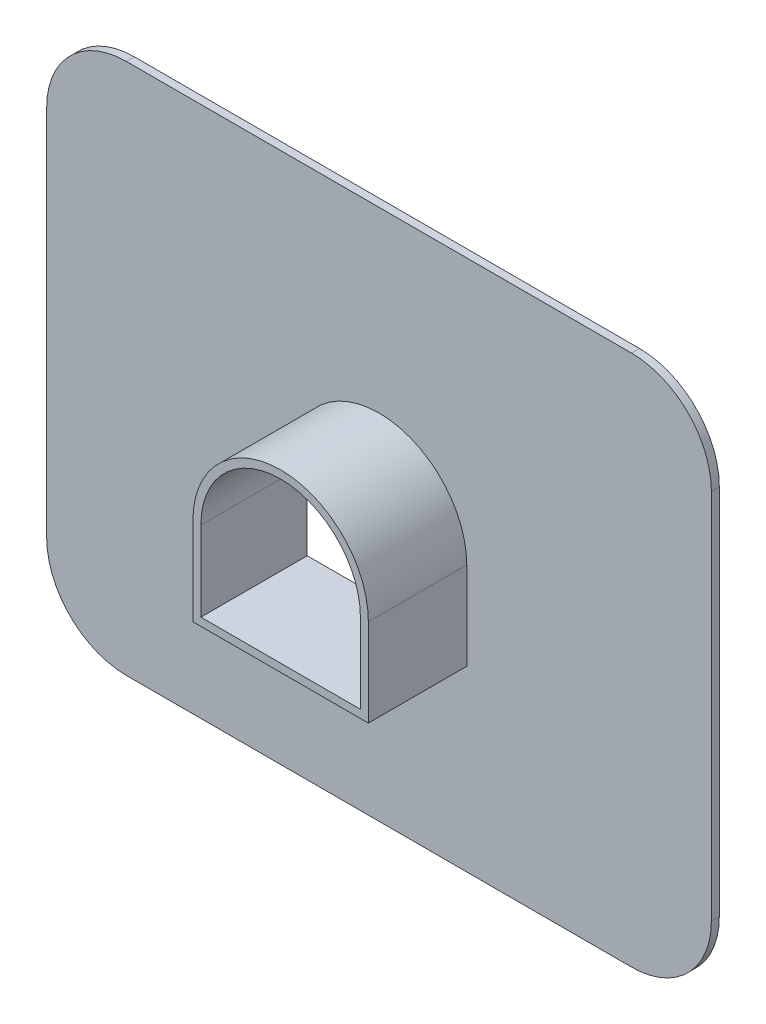
ISO-10303-21;
HEADER;
FILE_DESCRIPTION(('STEP AP214'),'2;1');
FILE_NAME('part.step','',(''),(''),'','','');
FILE_SCHEMA(('AUTOMOTIVE_DESIGN { 1 0 10303 214 1 1 1 1 }'));
ENDSEC;
DATA;
#1=APPLICATION_CONTEXT('core data for automotive mechanical design processes');
#2=APPLICATION_PROTOCOL_DEFINITION('international standard','automotive_design',2000,#1);
#3=PRODUCT_CONTEXT('',#1,'mechanical');
#4=PRODUCT('Part','Part','',(#3));
#5=PRODUCT_RELATED_PRODUCT_CATEGORY('part','',(#4));
#6=PRODUCT_DEFINITION_FORMATION('','',#4);
#7=PRODUCT_DEFINITION_CONTEXT('part definition',#1,'design');
#8=PRODUCT_DEFINITION('design','',#6,#7);
#9=PRODUCT_DEFINITION_SHAPE('','',#8);
#10=(LENGTH_UNIT() NAMED_UNIT(*) SI_UNIT(.MILLI.,.METRE.));
#11=(NAMED_UNIT(*) PLANE_ANGLE_UNIT() SI_UNIT($,.RADIAN.));
#12=(NAMED_UNIT(*) SI_UNIT($,.STERADIAN.) SOLID_ANGLE_UNIT());
#13=UNCERTAINTY_MEASURE_WITH_UNIT(LENGTH_MEASURE(1.E-05),#10,'distance_accuracy_value','');
#14=(GEOMETRIC_REPRESENTATION_CONTEXT(3) GLOBAL_UNCERTAINTY_ASSIGNED_CONTEXT((#13)) GLOBAL_UNIT_ASSIGNED_CONTEXT((#10,
#11,#12)) REPRESENTATION_CONTEXT('',''));
#15=CARTESIAN_POINT('',(0.,0.,0.));
#16=DIRECTION('',(0.,0.,1.));
#17=DIRECTION('',(1.,0.,0.));
#18=AXIS2_PLACEMENT_3D('',#15,#16,#17);
#19=CARTESIAN_POINT('',(9.5,7.,0.3));
#20=DIRECTION('',(0.,0.,-1.));
#21=DIRECTION('',(-1.,0.,0.));
#22=AXIS2_PLACEMENT_3D('',#19,#20,#21);
#23=PLANE('',#22);
#24=CARTESIAN_POINT('',(9.5,7.,0.3));
#25=DIRECTION('',(0.,0.,1.));
#26=DIRECTION('',(-1.,0.,0.));
#27=AXIS2_PLACEMENT_3D('',#24,#25,#26);
#28=CIRCLE('',#27,3.);
#29=CARTESIAN_POINT('',(12.5,6.99999999999998,0.3));
#30=VERTEX_POINT('',#29);
#31=CARTESIAN_POINT('',(9.49999999999998,10.,0.3));
#32=VERTEX_POINT('',#31);
#33=EDGE_CURVE('E214',#30,#32,#28,.T.);
#34=ORIENTED_EDGE('',*,*,#33,.T.);
#35=DIRECTION('',(-1.,0.,0.));
#36=VECTOR('',#35,1.);
#37=CARTESIAN_POINT('',(-9.49999999999998,10.,0.3));
#38=LINE('',#37,#36);
#39=CARTESIAN_POINT('',(-9.49999999999998,10.,0.3));
#40=VERTEX_POINT('',#39);
#41=EDGE_CURVE('E217',#32,#40,#38,.T.);
#42=ORIENTED_EDGE('',*,*,#41,.T.);
#43=CARTESIAN_POINT('',(-9.5,7.,0.3));
#44=DIRECTION('',(0.,0.,1.));
#45=DIRECTION('',(-1.,0.,0.));
#46=AXIS2_PLACEMENT_3D('',#43,#44,#45);
#47=CIRCLE('',#46,3.);
#48=CARTESIAN_POINT('',(-12.5,6.99999999999998,0.3));
#49=VERTEX_POINT('',#48);
#50=EDGE_CURVE('E220',#40,#49,#47,.T.);
#51=ORIENTED_EDGE('',*,*,#50,.T.);
#52=DIRECTION('',(0.,-1.,0.));
#53=VECTOR('',#52,1.);
#54=CARTESIAN_POINT('',(-12.5,6.99999999999998,0.3));
#55=LINE('',#54,#53);
#56=CARTESIAN_POINT('',(-12.5,-6.99999999999998,0.3));
#57=VERTEX_POINT('',#56);
#58=EDGE_CURVE('E222',#49,#57,#55,.T.);
#59=ORIENTED_EDGE('',*,*,#58,.T.);
#60=CARTESIAN_POINT('',(-9.5,-7.,0.3));
#61=DIRECTION('',(0.,0.,1.));
#62=DIRECTION('',(-1.,0.,0.));
#63=AXIS2_PLACEMENT_3D('',#60,#61,#62);
#64=CIRCLE('',#63,3.);
#65=CARTESIAN_POINT('',(-9.49999999999998,-10.,0.3));
#66=VERTEX_POINT('',#65);
#67=EDGE_CURVE('E224',#57,#66,#64,.T.);
#68=ORIENTED_EDGE('',*,*,#67,.T.);
#69=DIRECTION('',(1.,0.,0.));
#70=VECTOR('',#69,1.);
#71=CARTESIAN_POINT('',(-9.49999999999998,-10.,0.3));
#72=LINE('',#71,#70);
#73=CARTESIAN_POINT('',(9.49999999999998,-10.,0.3));
#74=VERTEX_POINT('',#73);
#75=EDGE_CURVE('E226',#66,#74,#72,.T.);
#76=ORIENTED_EDGE('',*,*,#75,.T.);
#77=CARTESIAN_POINT('',(9.50000000000001,-7.,0.3));
#78=DIRECTION('',(0.,0.,1.));
#79=DIRECTION('',(-1.,0.,0.));
#80=AXIS2_PLACEMENT_3D('',#77,#78,#79);
#81=CIRCLE('',#80,3.);
#82=CARTESIAN_POINT('',(12.5,-6.99999999999998,0.3));
#83=VERTEX_POINT('',#82);
#84=EDGE_CURVE('E228',#74,#83,#81,.T.);
#85=ORIENTED_EDGE('',*,*,#84,.T.);
#86=DIRECTION('',(0.,1.,0.));
#87=VECTOR('',#86,1.);
#88=CARTESIAN_POINT('',(12.5,6.99999999999998,0.3));
#89=LINE('',#88,#87);
#90=EDGE_CURVE('E230',#83,#30,#89,.T.);
#91=ORIENTED_EDGE('',*,*,#90,.T.);
#92=EDGE_LOOP('',(#34,#42,#51,#59,#68,#76,#85,#91));
#93=FACE_BOUND('',#92,.T.);
#94=DIRECTION('',(0.,-1.,0.));
#95=VECTOR('',#94,1.);
#96=CARTESIAN_POINT('',(-3.3,0.,0.3));
#97=LINE('',#96,#95);
#98=CARTESIAN_POINT('',(-3.3,0.,0.3));
#99=VERTEX_POINT('',#98);
#100=CARTESIAN_POINT('',(-3.3,-3.3,0.3));
#101=VERTEX_POINT('',#100);
#102=EDGE_CURVE('E173',#99,#101,#97,.T.);
#103=ORIENTED_EDGE('',*,*,#102,.F.);
#104=CARTESIAN_POINT('',(0.,0.,0.3));
#105=DIRECTION('',(0.,0.,1.));
#106=DIRECTION('',(1.,0.,0.));
#107=AXIS2_PLACEMENT_3D('',#104,#105,#106);
#108=CIRCLE('',#107,3.3);
#109=CARTESIAN_POINT('',(3.3,0.,0.3));
#110=VERTEX_POINT('',#109);
#111=EDGE_CURVE('E178',#110,#99,#108,.T.);
#112=ORIENTED_EDGE('',*,*,#111,.F.);
#113=DIRECTION('',(0.,1.,0.));
#114=VECTOR('',#113,1.);
#115=CARTESIAN_POINT('',(3.3,-3.3,0.3));
#116=LINE('',#115,#114);
#117=CARTESIAN_POINT('',(3.3,-3.3,0.3));
#118=VERTEX_POINT('',#117);
#119=EDGE_CURVE('E52',#118,#110,#116,.T.);
#120=ORIENTED_EDGE('',*,*,#119,.F.);
#121=DIRECTION('',(1.,0.,0.));
#122=VECTOR('',#121,1.);
#123=CARTESIAN_POINT('',(-3.3,-3.3,0.3));
#124=LINE('',#123,#122);
#125=EDGE_CURVE('E47',#101,#118,#124,.T.);
#126=ORIENTED_EDGE('',*,*,#125,.F.);
#127=EDGE_LOOP('',(#103,#112,#120,#126));
#128=FACE_BOUND('',#127,.T.);
#129=ADVANCED_FACE('F32',(#93,#128),#23,.F.);
#130=CARTESIAN_POINT('',(9.5,7.,0.));
#131=DIRECTION('',(0.,0.,-1.));
#132=DIRECTION('',(-1.,0.,0.));
#133=AXIS2_PLACEMENT_3D('',#130,#131,#132);
#134=PLANE('',#133);
#135=CARTESIAN_POINT('',(9.5,7.,0.));
#136=DIRECTION('',(0.,0.,1.));
#137=DIRECTION('',(-1.,0.,0.));
#138=AXIS2_PLACEMENT_3D('',#135,#136,#137);
#139=CIRCLE('',#138,3.);
#140=CARTESIAN_POINT('',(12.5,6.99999999999998,0.));
#141=VERTEX_POINT('',#140);
#142=CARTESIAN_POINT('',(9.49999999999998,10.,0.));
#143=VERTEX_POINT('',#142);
#144=EDGE_CURVE('E153',#141,#143,#139,.T.);
#145=ORIENTED_EDGE('',*,*,#144,.F.);
#146=DIRECTION('',(0.,1.,0.));
#147=VECTOR('',#146,1.);
#148=CARTESIAN_POINT('',(12.5,6.99999999999998,0.));
#149=LINE('',#148,#147);
#150=CARTESIAN_POINT('',(12.5,-6.99999999999998,0.));
#151=VERTEX_POINT('',#150);
#152=EDGE_CURVE('E218',#151,#141,#149,.T.);
#153=ORIENTED_EDGE('',*,*,#152,.F.);
#154=CARTESIAN_POINT('',(9.50000000000001,-7.,0.));
#155=DIRECTION('',(0.,0.,1.));
#156=DIRECTION('',(-1.,0.,0.));
#157=AXIS2_PLACEMENT_3D('',#154,#155,#156);
#158=CIRCLE('',#157,3.);
#159=CARTESIAN_POINT('',(9.49999999999998,-10.,0.));
#160=VERTEX_POINT('',#159);
#161=EDGE_CURVE('E245',#160,#151,#158,.T.);
#162=ORIENTED_EDGE('',*,*,#161,.F.);
#163=DIRECTION('',(1.,0.,0.));
#164=VECTOR('',#163,1.);
#165=CARTESIAN_POINT('',(-9.49999999999998,-10.,0.));
#166=LINE('',#165,#164);
#167=CARTESIAN_POINT('',(-9.49999999999998,-10.,0.));
#168=VERTEX_POINT('',#167);
#169=EDGE_CURVE('E243',#168,#160,#166,.T.);
#170=ORIENTED_EDGE('',*,*,#169,.F.);
#171=CARTESIAN_POINT('',(-9.5,-7.,0.));
#172=DIRECTION('',(0.,0.,1.));
#173=DIRECTION('',(-1.,0.,0.));
#174=AXIS2_PLACEMENT_3D('',#171,#172,#173);
#175=CIRCLE('',#174,3.);
#176=CARTESIAN_POINT('',(-12.5,-6.99999999999998,0.));
#177=VERTEX_POINT('',#176);
#178=EDGE_CURVE('E241',#177,#168,#175,.T.);
#179=ORIENTED_EDGE('',*,*,#178,.F.);
#180=DIRECTION('',(0.,-1.,0.));
#181=VECTOR('',#180,1.);
#182=CARTESIAN_POINT('',(-12.5,6.99999999999998,0.));
#183=LINE('',#182,#181);
#184=CARTESIAN_POINT('',(-12.5,6.99999999999998,0.));
#185=VERTEX_POINT('',#184);
#186=EDGE_CURVE('E239',#185,#177,#183,.T.);
#187=ORIENTED_EDGE('',*,*,#186,.F.);
#188=CARTESIAN_POINT('',(-9.5,7.,0.));
#189=DIRECTION('',(0.,0.,1.));
#190=DIRECTION('',(-1.,0.,0.));
#191=AXIS2_PLACEMENT_3D('',#188,#189,#190);
#192=CIRCLE('',#191,3.);
#193=CARTESIAN_POINT('',(-9.49999999999998,10.,0.));
#194=VERTEX_POINT('',#193);
#195=EDGE_CURVE('E237',#194,#185,#192,.T.);
#196=ORIENTED_EDGE('',*,*,#195,.F.);
#197=DIRECTION('',(-1.,0.,0.));
#198=VECTOR('',#197,1.);
#199=CARTESIAN_POINT('',(-9.49999999999998,10.,0.));
#200=LINE('',#199,#198);
#201=EDGE_CURVE('E235',#143,#194,#200,.T.);
#202=ORIENTED_EDGE('',*,*,#201,.F.);
#203=EDGE_LOOP('',(#145,#153,#162,#170,#179,#187,#196,#202));
#204=FACE_BOUND('',#203,.T.);
#205=CARTESIAN_POINT('',(0.,0.,0.));
#206=DIRECTION('',(0.,0.,1.));
#207=DIRECTION('',(-1.,0.,0.));
#208=AXIS2_PLACEMENT_3D('',#205,#206,#207);
#209=CIRCLE('',#208,3.);
#210=CARTESIAN_POINT('',(3.,0.,0.));
#211=VERTEX_POINT('',#210);
#212=CARTESIAN_POINT('',(-3.,0.,0.));
#213=VERTEX_POINT('',#212);
#214=EDGE_CURVE('E207',#211,#213,#209,.T.);
#215=ORIENTED_EDGE('',*,*,#214,.T.);
#216=DIRECTION('',(0.,-1.,0.));
#217=VECTOR('',#216,1.);
#218=CARTESIAN_POINT('',(-3.,-3.,0.));
#219=LINE('',#218,#217);
#220=CARTESIAN_POINT('',(-3.,-3.,0.));
#221=VERTEX_POINT('',#220);
#222=EDGE_CURVE('E201',#213,#221,#219,.T.);
#223=ORIENTED_EDGE('',*,*,#222,.T.);
#224=DIRECTION('',(1.,0.,0.));
#225=VECTOR('',#224,1.);
#226=CARTESIAN_POINT('',(-3.,-3.,0.));
#227=LINE('',#226,#225);
#228=CARTESIAN_POINT('',(3.,-3.,0.));
#229=VERTEX_POINT('',#228);
#230=EDGE_CURVE('E150',#221,#229,#227,.T.);
#231=ORIENTED_EDGE('',*,*,#230,.T.);
#232=DIRECTION('',(0.,1.,0.));
#233=VECTOR('',#232,1.);
#234=CARTESIAN_POINT('',(3.,-3.,0.));
#235=LINE('',#234,#233);
#236=EDGE_CURVE('E204',#229,#211,#235,.T.);
#237=ORIENTED_EDGE('',*,*,#236,.T.);
#238=EDGE_LOOP('',(#215,#223,#231,#237));
#239=FACE_BOUND('',#238,.T.);
#240=ADVANCED_FACE('F275',(#204,#239),#134,.T.);
#241=CARTESIAN_POINT('',(9.5,7.,0.3));
#242=DIRECTION('',(0.,0.,-1.));
#243=DIRECTION('',(-1.,0.,0.));
#244=AXIS2_PLACEMENT_3D('',#241,#242,#243);
#245=CYLINDRICAL_SURFACE('',#244,3.);
#246=ORIENTED_EDGE('',*,*,#144,.T.);
#247=DIRECTION('',(0.,0.,-1.));
#248=VECTOR('',#247,1.);
#249=CARTESIAN_POINT('',(9.49999999999998,10.,0.3));
#250=LINE('',#249,#248);
#251=EDGE_CURVE('E11',#32,#143,#250,.T.);
#252=ORIENTED_EDGE('',*,*,#251,.F.);
#253=ORIENTED_EDGE('',*,*,#33,.F.);
#254=DIRECTION('',(0.,0.,-1.));
#255=VECTOR('',#254,1.);
#256=CARTESIAN_POINT('',(12.5,6.99999999999998,0.3));
#257=LINE('',#256,#255);
#258=EDGE_CURVE('E232',#30,#141,#257,.T.);
#259=ORIENTED_EDGE('',*,*,#258,.T.);
#260=EDGE_LOOP('',(#246,#252,#253,#259));
#261=FACE_BOUND('',#260,.T.);
#262=ADVANCED_FACE('F34',(#261),#245,.T.);
#263=CARTESIAN_POINT('',(-9.49999999999998,10.,0.3));
#264=DIRECTION('',(0.,-1.,0.));
#265=DIRECTION('',(1.,0.,0.));
#266=AXIS2_PLACEMENT_3D('',#263,#264,#265);
#267=PLANE('',#266);
#268=ORIENTED_EDGE('',*,*,#201,.T.);
#269=DIRECTION('',(0.,0.,-1.));
#270=VECTOR('',#269,1.);
#271=CARTESIAN_POINT('',(-9.49999999999998,10.,0.3));
#272=LINE('',#271,#270);
#273=EDGE_CURVE('E40',#40,#194,#272,.T.);
#274=ORIENTED_EDGE('',*,*,#273,.F.);
#275=ORIENTED_EDGE('',*,*,#41,.F.);
#276=ORIENTED_EDGE('',*,*,#251,.T.);
#277=EDGE_LOOP('',(#268,#274,#275,#276));
#278=FACE_BOUND('',#277,.T.);
#279=ADVANCED_FACE('F292',(#278),#267,.F.);
#280=CARTESIAN_POINT('',(-9.5,7.,0.3));
#281=DIRECTION('',(0.,0.,-1.));
#282=DIRECTION('',(-1.,0.,0.));
#283=AXIS2_PLACEMENT_3D('',#280,#281,#282);
#284=CYLINDRICAL_SURFACE('',#283,3.);
#285=ORIENTED_EDGE('',*,*,#195,.T.);
#286=DIRECTION('',(0.,0.,-1.));
#287=VECTOR('',#286,1.);
#288=CARTESIAN_POINT('',(-12.5,6.99999999999998,0.3));
#289=LINE('',#288,#287);
#290=EDGE_CURVE('E262',#49,#185,#289,.T.);
#291=ORIENTED_EDGE('',*,*,#290,.F.);
#292=ORIENTED_EDGE('',*,*,#50,.F.);
#293=ORIENTED_EDGE('',*,*,#273,.T.);
#294=EDGE_LOOP('',(#285,#291,#292,#293));
#295=FACE_BOUND('',#294,.T.);
#296=ADVANCED_FACE('F269',(#295),#284,.T.);
#297=CARTESIAN_POINT('',(-12.5,6.99999999999998,0.3));
#298=DIRECTION('',(1.,0.,0.));
#299=DIRECTION('',(0.,1.,0.));
#300=AXIS2_PLACEMENT_3D('',#297,#298,#299);
#301=PLANE('',#300);
#302=ORIENTED_EDGE('',*,*,#186,.T.);
#303=DIRECTION('',(0.,0.,-1.));
#304=VECTOR('',#303,1.);
#305=CARTESIAN_POINT('',(-12.5,-6.99999999999998,0.3));
#306=LINE('',#305,#304);
#307=EDGE_CURVE('E259',#57,#177,#306,.T.);
#308=ORIENTED_EDGE('',*,*,#307,.F.);
#309=ORIENTED_EDGE('',*,*,#58,.F.);
#310=ORIENTED_EDGE('',*,*,#290,.T.);
#311=EDGE_LOOP('',(#302,#308,#309,#310));
#312=FACE_BOUND('',#311,.T.);
#313=ADVANCED_FACE('F281',(#312),#301,.F.);
#314=CARTESIAN_POINT('',(-9.5,-7.,0.3));
#315=DIRECTION('',(0.,0.,-1.));
#316=DIRECTION('',(-1.,0.,0.));
#317=AXIS2_PLACEMENT_3D('',#314,#315,#316);
#318=CYLINDRICAL_SURFACE('',#317,3.);
#319=ORIENTED_EDGE('',*,*,#178,.T.);
#320=DIRECTION('',(0.,0.,-1.));
#321=VECTOR('',#320,1.);
#322=CARTESIAN_POINT('',(-9.49999999999998,-10.,0.3));
#323=LINE('',#322,#321);
#324=EDGE_CURVE('E256',#66,#168,#323,.T.);
#325=ORIENTED_EDGE('',*,*,#324,.F.);
#326=ORIENTED_EDGE('',*,*,#67,.F.);
#327=ORIENTED_EDGE('',*,*,#307,.T.);
#328=EDGE_LOOP('',(#319,#325,#326,#327));
#329=FACE_BOUND('',#328,.T.);
#330=ADVANCED_FACE('F285',(#329),#318,.T.);
#331=CARTESIAN_POINT('',(-9.49999999999998,-10.,0.3));
#332=DIRECTION('',(0.,1.,0.));
#333=DIRECTION('',(0.,0.,1.));
#334=AXIS2_PLACEMENT_3D('',#331,#332,#333);
#335=PLANE('',#334);
#336=ORIENTED_EDGE('',*,*,#169,.T.);
#337=DIRECTION('',(0.,0.,-1.));
#338=VECTOR('',#337,1.);
#339=CARTESIAN_POINT('',(9.49999999999998,-10.,0.3));
#340=LINE('',#339,#338);
#341=EDGE_CURVE('E253',#74,#160,#340,.T.);
#342=ORIENTED_EDGE('',*,*,#341,.F.);
#343=ORIENTED_EDGE('',*,*,#75,.F.);
#344=ORIENTED_EDGE('',*,*,#324,.T.);
#345=EDGE_LOOP('',(#336,#342,#343,#344));
#346=FACE_BOUND('',#345,.T.);
#347=ADVANCED_FACE('F305',(#346),#335,.F.);
#348=CARTESIAN_POINT('',(9.50000000000001,-7.,0.3));
#349=DIRECTION('',(0.,0.,-1.));
#350=DIRECTION('',(-1.,0.,0.));
#351=AXIS2_PLACEMENT_3D('',#348,#349,#350);
#352=CYLINDRICAL_SURFACE('',#351,3.);
#353=ORIENTED_EDGE('',*,*,#161,.T.);
#354=DIRECTION('',(0.,0.,-1.));
#355=VECTOR('',#354,1.);
#356=CARTESIAN_POINT('',(12.5,-6.99999999999998,0.3));
#357=LINE('',#356,#355);
#358=EDGE_CURVE('E250',#83,#151,#357,.T.);
#359=ORIENTED_EDGE('',*,*,#358,.F.);
#360=ORIENTED_EDGE('',*,*,#84,.F.);
#361=ORIENTED_EDGE('',*,*,#341,.T.);
#362=EDGE_LOOP('',(#353,#359,#360,#361));
#363=FACE_BOUND('',#362,.T.);
#364=ADVANCED_FACE('F303',(#363),#352,.T.);
#365=CARTESIAN_POINT('',(12.5,6.99999999999998,0.3));
#366=DIRECTION('',(-1.,0.,0.));
#367=DIRECTION('',(0.,-1.,0.));
#368=AXIS2_PLACEMENT_3D('',#365,#366,#367);
#369=PLANE('',#368);
#370=ORIENTED_EDGE('',*,*,#152,.T.);
#371=ORIENTED_EDGE('',*,*,#258,.F.);
#372=ORIENTED_EDGE('',*,*,#90,.F.);
#373=ORIENTED_EDGE('',*,*,#358,.T.);
#374=EDGE_LOOP('',(#370,#371,#372,#373));
#375=FACE_BOUND('',#374,.T.);
#376=ADVANCED_FACE('F298',(#375),#369,.F.);
#377=CARTESIAN_POINT('',(-3.,-3.,0.3));
#378=DIRECTION('',(1.,0.,0.));
#379=DIRECTION('',(0.,0.,-1.));
#380=AXIS2_PLACEMENT_3D('',#377,#378,#379);
#381=PLANE('',#380);
#382=ORIENTED_EDGE('',*,*,#222,.F.);
#383=DIRECTION('',(0.,0.,-1.));
#384=VECTOR('',#383,1.);
#385=CARTESIAN_POINT('',(-3.,0.,0.3));
#386=LINE('',#385,#384);
#387=CARTESIAN_POINT('',(-3.,0.,4.));
#388=VERTEX_POINT('',#387);
#389=EDGE_CURVE('E160',#388,#213,#386,.T.);
#390=ORIENTED_EDGE('',*,*,#389,.F.);
#391=DIRECTION('',(0.,-1.,0.));
#392=VECTOR('',#391,1.);
#393=CARTESIAN_POINT('',(-3.,0.,4.));
#394=LINE('',#393,#392);
#395=CARTESIAN_POINT('',(-3.,-3.,4.));
#396=VERTEX_POINT('',#395);
#397=EDGE_CURVE('E157',#388,#396,#394,.T.);
#398=ORIENTED_EDGE('',*,*,#397,.T.);
#399=DIRECTION('',(0.,0.,-1.));
#400=VECTOR('',#399,1.);
#401=CARTESIAN_POINT('',(-3.,-3.,0.3));
#402=LINE('',#401,#400);
#403=EDGE_CURVE('E143',#396,#221,#402,.T.);
#404=ORIENTED_EDGE('',*,*,#403,.T.);
#405=EDGE_LOOP('',(#382,#390,#398,#404));
#406=FACE_BOUND('',#405,.T.);
#407=ADVANCED_FACE('F158',(#406),#381,.T.);
#408=CARTESIAN_POINT('',(-3.,-3.,0.3));
#409=DIRECTION('',(0.,1.,0.));
#410=DIRECTION('',(0.,0.,1.));
#411=AXIS2_PLACEMENT_3D('',#408,#409,#410);
#412=PLANE('',#411);
#413=ORIENTED_EDGE('',*,*,#230,.F.);
#414=ORIENTED_EDGE('',*,*,#403,.F.);
#415=DIRECTION('',(1.,0.,0.));
#416=VECTOR('',#415,1.);
#417=CARTESIAN_POINT('',(-3.,-3.,4.));
#418=LINE('',#417,#416);
#419=CARTESIAN_POINT('',(3.,-3.,4.));
#420=VERTEX_POINT('',#419);
#421=EDGE_CURVE('E147',#396,#420,#418,.T.);
#422=ORIENTED_EDGE('',*,*,#421,.T.);
#423=DIRECTION('',(0.,0.,-1.));
#424=VECTOR('',#423,1.);
#425=CARTESIAN_POINT('',(3.,-3.,0.3));
#426=LINE('',#425,#424);
#427=EDGE_CURVE('E154',#420,#229,#426,.T.);
#428=ORIENTED_EDGE('',*,*,#427,.T.);
#429=EDGE_LOOP('',(#413,#414,#422,#428));
#430=FACE_BOUND('',#429,.T.);
#431=ADVANCED_FACE('F145',(#430),#412,.T.);
#432=CARTESIAN_POINT('',(3.,-3.,0.3));
#433=DIRECTION('',(-1.,0.,0.));
#434=DIRECTION('',(0.,0.,1.));
#435=AXIS2_PLACEMENT_3D('',#432,#433,#434);
#436=PLANE('',#435);
#437=ORIENTED_EDGE('',*,*,#236,.F.);
#438=ORIENTED_EDGE('',*,*,#427,.F.);
#439=DIRECTION('',(0.,1.,0.));
#440=VECTOR('',#439,1.);
#441=CARTESIAN_POINT('',(3.,-3.,4.));
#442=LINE('',#441,#440);
#443=CARTESIAN_POINT('',(3.,0.,4.));
#444=VERTEX_POINT('',#443);
#445=EDGE_CURVE('E167',#420,#444,#442,.T.);
#446=ORIENTED_EDGE('',*,*,#445,.T.);
#447=DIRECTION('',(0.,0.,-1.));
#448=VECTOR('',#447,1.);
#449=CARTESIAN_POINT('',(3.,0.,0.3));
#450=LINE('',#449,#448);
#451=EDGE_CURVE('E211',#444,#211,#450,.T.);
#452=ORIENTED_EDGE('',*,*,#451,.T.);
#453=EDGE_LOOP('',(#437,#438,#446,#452));
#454=FACE_BOUND('',#453,.T.);
#455=ADVANCED_FACE('F330',(#454),#436,.T.);
#456=CARTESIAN_POINT('',(0.,0.,0.3));
#457=DIRECTION('',(0.,0.,-1.));
#458=DIRECTION('',(-1.,0.,0.));
#459=AXIS2_PLACEMENT_3D('',#456,#457,#458);
#460=CYLINDRICAL_SURFACE('',#459,3.);
#461=ORIENTED_EDGE('',*,*,#214,.F.);
#462=ORIENTED_EDGE('',*,*,#451,.F.);
#463=CARTESIAN_POINT('',(0.,0.,4.));
#464=DIRECTION('',(0.,0.,1.));
#465=DIRECTION('',(1.,0.,0.));
#466=AXIS2_PLACEMENT_3D('',#463,#464,#465);
#467=CIRCLE('',#466,3.);
#468=EDGE_CURVE('E169',#444,#388,#467,.T.);
#469=ORIENTED_EDGE('',*,*,#468,.T.);
#470=ORIENTED_EDGE('',*,*,#389,.T.);
#471=EDGE_LOOP('',(#461,#462,#469,#470));
#472=FACE_BOUND('',#471,.T.);
#473=ADVANCED_FACE('F334',(#472),#460,.F.);
#474=CARTESIAN_POINT('',(0.,0.,4.));
#475=DIRECTION('',(0.,0.,1.));
#476=DIRECTION('',(1.,0.,0.));
#477=AXIS2_PLACEMENT_3D('',#474,#475,#476);
#478=PLANE('',#477);
#479=DIRECTION('',(0.,-1.,0.));
#480=VECTOR('',#479,1.);
#481=CARTESIAN_POINT('',(-3.3,0.,4.));
#482=LINE('',#481,#480);
#483=CARTESIAN_POINT('',(-3.3,0.,4.));
#484=VERTEX_POINT('',#483);
#485=CARTESIAN_POINT('',(-3.3,-3.3,4.));
#486=VERTEX_POINT('',#485);
#487=EDGE_CURVE('E174',#484,#486,#482,.T.);
#488=ORIENTED_EDGE('',*,*,#487,.T.);
#489=DIRECTION('',(1.,0.,0.));
#490=VECTOR('',#489,1.);
#491=CARTESIAN_POINT('',(-3.3,-3.3,4.));
#492=LINE('',#491,#490);
#493=CARTESIAN_POINT('',(3.3,-3.3,4.));
#494=VERTEX_POINT('',#493);
#495=EDGE_CURVE('E177',#486,#494,#492,.T.);
#496=ORIENTED_EDGE('',*,*,#495,.T.);
#497=DIRECTION('',(0.,1.,0.));
#498=VECTOR('',#497,1.);
#499=CARTESIAN_POINT('',(3.3,-3.3,4.));
#500=LINE('',#499,#498);
#501=CARTESIAN_POINT('',(3.3,0.,4.));
#502=VERTEX_POINT('',#501);
#503=EDGE_CURVE('E180',#494,#502,#500,.T.);
#504=ORIENTED_EDGE('',*,*,#503,.T.);
#505=CARTESIAN_POINT('',(0.,0.,4.));
#506=DIRECTION('',(0.,0.,1.));
#507=DIRECTION('',(1.,0.,0.));
#508=AXIS2_PLACEMENT_3D('',#505,#506,#507);
#509=CIRCLE('',#508,3.3);
#510=EDGE_CURVE('E182',#502,#484,#509,.T.);
#511=ORIENTED_EDGE('',*,*,#510,.T.);
#512=EDGE_LOOP('',(#488,#496,#504,#511));
#513=FACE_BOUND('',#512,.T.);
#514=ORIENTED_EDGE('',*,*,#421,.F.);
#515=ORIENTED_EDGE('',*,*,#397,.F.);
#516=ORIENTED_EDGE('',*,*,#468,.F.);
#517=ORIENTED_EDGE('',*,*,#445,.F.);
#518=EDGE_LOOP('',(#514,#515,#516,#517));
#519=FACE_BOUND('',#518,.T.);
#520=ADVANCED_FACE('F165',(#513,#519),#478,.T.);
#521=CARTESIAN_POINT('',(-3.3,0.,4.));
#522=DIRECTION('',(1.,0.,0.));
#523=DIRECTION('',(0.,0.,-1.));
#524=AXIS2_PLACEMENT_3D('',#521,#522,#523);
#525=PLANE('',#524);
#526=ORIENTED_EDGE('',*,*,#102,.T.);
#527=DIRECTION('',(0.,0.,-1.));
#528=VECTOR('',#527,1.);
#529=CARTESIAN_POINT('',(-3.3,-3.3,4.));
#530=LINE('',#529,#528);
#531=EDGE_CURVE('E199',#486,#101,#530,.T.);
#532=ORIENTED_EDGE('',*,*,#531,.F.);
#533=ORIENTED_EDGE('',*,*,#487,.F.);
#534=DIRECTION('',(0.,0.,-1.));
#535=VECTOR('',#534,1.);
#536=CARTESIAN_POINT('',(-3.3,0.,4.));
#537=LINE('',#536,#535);
#538=EDGE_CURVE('E184',#484,#99,#537,.T.);
#539=ORIENTED_EDGE('',*,*,#538,.T.);
#540=EDGE_LOOP('',(#526,#532,#533,#539));
#541=FACE_BOUND('',#540,.T.);
#542=ADVANCED_FACE('F341',(#541),#525,.F.);
#543=CARTESIAN_POINT('',(-3.3,-3.3,4.));
#544=DIRECTION('',(0.,1.,0.));
#545=DIRECTION('',(0.,0.,1.));
#546=AXIS2_PLACEMENT_3D('',#543,#544,#545);
#547=PLANE('',#546);
#548=ORIENTED_EDGE('',*,*,#125,.T.);
#549=DIRECTION('',(0.,0.,-1.));
#550=VECTOR('',#549,1.);
#551=CARTESIAN_POINT('',(3.3,-3.3,4.));
#552=LINE('',#551,#550);
#553=EDGE_CURVE('E196',#494,#118,#552,.T.);
#554=ORIENTED_EDGE('',*,*,#553,.F.);
#555=ORIENTED_EDGE('',*,*,#495,.F.);
#556=ORIENTED_EDGE('',*,*,#531,.T.);
#557=EDGE_LOOP('',(#548,#554,#555,#556));
#558=FACE_BOUND('',#557,.T.);
#559=ADVANCED_FACE('F344',(#558),#547,.F.);
#560=CARTESIAN_POINT('',(3.3,-3.3,4.));
#561=DIRECTION('',(-1.,0.,0.));
#562=DIRECTION('',(0.,0.,1.));
#563=AXIS2_PLACEMENT_3D('',#560,#561,#562);
#564=PLANE('',#563);
#565=ORIENTED_EDGE('',*,*,#119,.T.);
#566=DIRECTION('',(0.,0.,-1.));
#567=VECTOR('',#566,1.);
#568=CARTESIAN_POINT('',(3.3,0.,4.));
#569=LINE('',#568,#567);
#570=EDGE_CURVE('E193',#502,#110,#569,.T.);
#571=ORIENTED_EDGE('',*,*,#570,.F.);
#572=ORIENTED_EDGE('',*,*,#503,.F.);
#573=ORIENTED_EDGE('',*,*,#553,.T.);
#574=EDGE_LOOP('',(#565,#571,#572,#573));
#575=FACE_BOUND('',#574,.T.);
#576=ADVANCED_FACE('F348',(#575),#564,.F.);
#577=CARTESIAN_POINT('',(0.,0.,4.));
#578=DIRECTION('',(0.,0.,-1.));
#579=DIRECTION('',(-1.,0.,0.));
#580=AXIS2_PLACEMENT_3D('',#577,#578,#579);
#581=CYLINDRICAL_SURFACE('',#580,3.3);
#582=ORIENTED_EDGE('',*,*,#111,.T.);
#583=ORIENTED_EDGE('',*,*,#538,.F.);
#584=ORIENTED_EDGE('',*,*,#510,.F.);
#585=ORIENTED_EDGE('',*,*,#570,.T.);
#586=EDGE_LOOP('',(#582,#583,#584,#585));
#587=FACE_BOUND('',#586,.T.);
#588=ADVANCED_FACE('F352',(#587),#581,.T.);
#589=CLOSED_SHELL('',(#129,#240,#262,#279,#296,#313,#330,#347,#364,#376,#407,#431,#455,#473,
#520,#542,#559,#576,#588));
#590=MANIFOLD_SOLID_BREP('B2',#589);
#591=ADVANCED_BREP_SHAPE_REPRESENTATION('',(#18,#590),#14);
#592=SHAPE_DEFINITION_REPRESENTATION(#9,#591);
ENDSEC;
END-ISO-10303-21;
